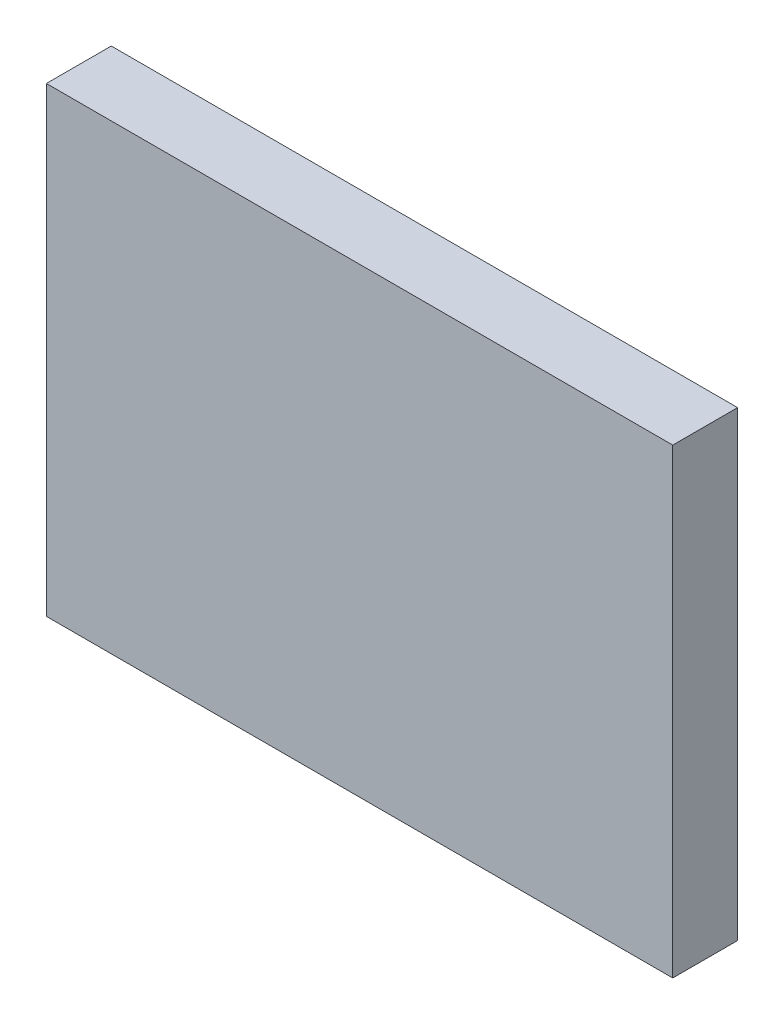
ISO-10303-21;
HEADER;
FILE_DESCRIPTION(('STEP AP214'),'2;1');
FILE_NAME('part.step','',(''),(''),'','','');
FILE_SCHEMA(('AUTOMOTIVE_DESIGN { 1 0 10303 214 1 1 1 1 }'));
ENDSEC;
DATA;
#1=APPLICATION_CONTEXT('core data for automotive mechanical design processes');
#2=APPLICATION_PROTOCOL_DEFINITION('international standard','automotive_design',2000,#1);
#3=PRODUCT_CONTEXT('',#1,'mechanical');
#4=PRODUCT('Part','Part','',(#3));
#5=PRODUCT_RELATED_PRODUCT_CATEGORY('part','',(#4));
#6=PRODUCT_DEFINITION_FORMATION('','',#4);
#7=PRODUCT_DEFINITION_CONTEXT('part definition',#1,'design');
#8=PRODUCT_DEFINITION('design','',#6,#7);
#9=PRODUCT_DEFINITION_SHAPE('','',#8);
#10=(LENGTH_UNIT() NAMED_UNIT(*) SI_UNIT(.MILLI.,.METRE.));
#11=(NAMED_UNIT(*) PLANE_ANGLE_UNIT() SI_UNIT($,.RADIAN.));
#12=(NAMED_UNIT(*) SI_UNIT($,.STERADIAN.) SOLID_ANGLE_UNIT());
#13=UNCERTAINTY_MEASURE_WITH_UNIT(LENGTH_MEASURE(1.E-05),#10,'distance_accuracy_value','');
#14=(GEOMETRIC_REPRESENTATION_CONTEXT(3) GLOBAL_UNCERTAINTY_ASSIGNED_CONTEXT((#13)) GLOBAL_UNIT_ASSIGNED_CONTEXT((#10,
#11,#12)) REPRESENTATION_CONTEXT('',''));
#15=CARTESIAN_POINT('',(0.,0.,0.));
#16=DIRECTION('',(0.,0.,1.));
#17=DIRECTION('',(1.,0.,0.));
#18=AXIS2_PLACEMENT_3D('',#15,#16,#17);
#19=CARTESIAN_POINT('',(-4.826,-3.556,1.));
#20=DIRECTION('',(1.,0.,0.));
#21=DIRECTION('',(0.,0.,-1.));
#22=AXIS2_PLACEMENT_3D('',#19,#20,#21);
#23=PLANE('',#22);
#24=DIRECTION('',(0.,-1.,0.));
#25=VECTOR('',#24,1.);
#26=CARTESIAN_POINT('',(-4.826,-3.556,0.));
#27=LINE('',#26,#25);
#28=CARTESIAN_POINT('',(-4.826,3.556,0.));
#29=VERTEX_POINT('',#28);
#30=CARTESIAN_POINT('',(-4.826,-3.556,0.));
#31=VERTEX_POINT('',#30);
#32=EDGE_CURVE('E95',#29,#31,#27,.T.);
#33=ORIENTED_EDGE('',*,*,#32,.T.);
#34=DIRECTION('',(0.,0.,-1.));
#35=VECTOR('',#34,1.);
#36=CARTESIAN_POINT('',(-4.826,-3.556,1.));
#37=LINE('',#36,#35);
#38=CARTESIAN_POINT('',(-4.826,-3.556,1.));
#39=VERTEX_POINT('',#38);
#40=EDGE_CURVE('E11',#39,#31,#37,.T.);
#41=ORIENTED_EDGE('',*,*,#40,.F.);
#42=DIRECTION('',(0.,-1.,0.));
#43=VECTOR('',#42,1.);
#44=CARTESIAN_POINT('',(-4.826,-3.556,1.));
#45=LINE('',#44,#43);
#46=CARTESIAN_POINT('',(-4.826,3.556,1.));
#47=VERTEX_POINT('',#46);
#48=EDGE_CURVE('E83',#47,#39,#45,.T.);
#49=ORIENTED_EDGE('',*,*,#48,.F.);
#50=DIRECTION('',(0.,0.,-1.));
#51=VECTOR('',#50,1.);
#52=CARTESIAN_POINT('',(-4.826,3.556,1.));
#53=LINE('',#52,#51);
#54=EDGE_CURVE('E91',#47,#29,#53,.T.);
#55=ORIENTED_EDGE('',*,*,#54,.T.);
#56=EDGE_LOOP('',(#33,#41,#49,#55));
#57=FACE_BOUND('',#56,.T.);
#58=ADVANCED_FACE('F32',(#57),#23,.F.);
#59=CARTESIAN_POINT('',(4.826,-3.556,1.));
#60=DIRECTION('',(0.,1.,0.));
#61=DIRECTION('',(0.,0.,1.));
#62=AXIS2_PLACEMENT_3D('',#59,#60,#61);
#63=PLANE('',#62);
#64=DIRECTION('',(1.,0.,0.));
#65=VECTOR('',#64,1.);
#66=CARTESIAN_POINT('',(4.826,-3.556,0.));
#67=LINE('',#66,#65);
#68=CARTESIAN_POINT('',(4.826,-3.556,0.));
#69=VERTEX_POINT('',#68);
#70=EDGE_CURVE('E87',#31,#69,#67,.T.);
#71=ORIENTED_EDGE('',*,*,#70,.T.);
#72=DIRECTION('',(0.,0.,-1.));
#73=VECTOR('',#72,1.);
#74=CARTESIAN_POINT('',(4.826,-3.556,1.));
#75=LINE('',#74,#73);
#76=CARTESIAN_POINT('',(4.826,-3.556,1.));
#77=VERTEX_POINT('',#76);
#78=EDGE_CURVE('E40',#77,#69,#75,.T.);
#79=ORIENTED_EDGE('',*,*,#78,.F.);
#80=DIRECTION('',(1.,0.,0.));
#81=VECTOR('',#80,1.);
#82=CARTESIAN_POINT('',(4.826,-3.556,1.));
#83=LINE('',#82,#81);
#84=EDGE_CURVE('E78',#39,#77,#83,.T.);
#85=ORIENTED_EDGE('',*,*,#84,.F.);
#86=ORIENTED_EDGE('',*,*,#40,.T.);
#87=EDGE_LOOP('',(#71,#79,#85,#86));
#88=FACE_BOUND('',#87,.T.);
#89=ADVANCED_FACE('F86',(#88),#63,.F.);
#90=CARTESIAN_POINT('',(4.826,3.556,1.));
#91=DIRECTION('',(-1.,0.,0.));
#92=DIRECTION('',(0.,0.,1.));
#93=AXIS2_PLACEMENT_3D('',#90,#91,#92);
#94=PLANE('',#93);
#95=DIRECTION('',(0.,1.,0.));
#96=VECTOR('',#95,1.);
#97=CARTESIAN_POINT('',(4.826,3.556,0.));
#98=LINE('',#97,#96);
#99=CARTESIAN_POINT('',(4.826,3.556,0.));
#100=VERTEX_POINT('',#99);
#101=EDGE_CURVE('E65',#69,#100,#98,.T.);
#102=ORIENTED_EDGE('',*,*,#101,.T.);
#103=DIRECTION('',(0.,0.,-1.));
#104=VECTOR('',#103,1.);
#105=CARTESIAN_POINT('',(4.826,3.556,1.));
#106=LINE('',#105,#104);
#107=CARTESIAN_POINT('',(4.826,3.556,1.));
#108=VERTEX_POINT('',#107);
#109=EDGE_CURVE('E88',#108,#100,#106,.T.);
#110=ORIENTED_EDGE('',*,*,#109,.F.);
#111=DIRECTION('',(0.,1.,0.));
#112=VECTOR('',#111,1.);
#113=CARTESIAN_POINT('',(4.826,3.556,1.));
#114=LINE('',#113,#112);
#115=EDGE_CURVE('E81',#77,#108,#114,.T.);
#116=ORIENTED_EDGE('',*,*,#115,.F.);
#117=ORIENTED_EDGE('',*,*,#78,.T.);
#118=EDGE_LOOP('',(#102,#110,#116,#117));
#119=FACE_BOUND('',#118,.T.);
#120=ADVANCED_FACE('F89',(#119),#94,.F.);
#121=CARTESIAN_POINT('',(-4.826,3.556,1.));
#122=DIRECTION('',(0.,-1.,0.));
#123=DIRECTION('',(0.,0.,-1.));
#124=AXIS2_PLACEMENT_3D('',#121,#122,#123);
#125=PLANE('',#124);
#126=DIRECTION('',(-1.,0.,0.));
#127=VECTOR('',#126,1.);
#128=CARTESIAN_POINT('',(-4.826,3.556,0.));
#129=LINE('',#128,#127);
#130=EDGE_CURVE('E71',#100,#29,#129,.T.);
#131=ORIENTED_EDGE('',*,*,#130,.T.);
#132=ORIENTED_EDGE('',*,*,#54,.F.);
#133=DIRECTION('',(-1.,0.,0.));
#134=VECTOR('',#133,1.);
#135=CARTESIAN_POINT('',(-4.826,3.556,1.));
#136=LINE('',#135,#134);
#137=EDGE_CURVE('E48',#108,#47,#136,.T.);
#138=ORIENTED_EDGE('',*,*,#137,.F.);
#139=ORIENTED_EDGE('',*,*,#109,.T.);
#140=EDGE_LOOP('',(#131,#132,#138,#139));
#141=FACE_BOUND('',#140,.T.);
#142=ADVANCED_FACE('F102',(#141),#125,.F.);
#143=CARTESIAN_POINT('',(0.,0.,1.));
#144=DIRECTION('',(0.,0.,-1.));
#145=DIRECTION('',(-1.,0.,0.));
#146=AXIS2_PLACEMENT_3D('',#143,#144,#145);
#147=PLANE('',#146);
#148=ORIENTED_EDGE('',*,*,#48,.T.);
#149=ORIENTED_EDGE('',*,*,#84,.T.);
#150=ORIENTED_EDGE('',*,*,#115,.T.);
#151=ORIENTED_EDGE('',*,*,#137,.T.);
#152=EDGE_LOOP('',(#148,#149,#150,#151));
#153=FACE_BOUND('',#152,.T.);
#154=ADVANCED_FACE('F79',(#153),#147,.F.);
#155=CARTESIAN_POINT('',(0.,0.,0.));
#156=DIRECTION('',(0.,0.,-1.));
#157=DIRECTION('',(-1.,0.,0.));
#158=AXIS2_PLACEMENT_3D('',#155,#156,#157);
#159=PLANE('',#158);
#160=ORIENTED_EDGE('',*,*,#32,.F.);
#161=ORIENTED_EDGE('',*,*,#130,.F.);
#162=ORIENTED_EDGE('',*,*,#101,.F.);
#163=ORIENTED_EDGE('',*,*,#70,.F.);
#164=EDGE_LOOP('',(#160,#161,#162,#163));
#165=FACE_BOUND('',#164,.T.);
#166=ADVANCED_FACE('F105',(#165),#159,.T.);
#167=CLOSED_SHELL('',(#58,#89,#120,#142,#154,#166));
#168=MANIFOLD_SOLID_BREP('B2',#167);
#169=ADVANCED_BREP_SHAPE_REPRESENTATION('',(#18,#168),#14);
#170=SHAPE_DEFINITION_REPRESENTATION(#9,#169);
ENDSEC;
END-ISO-10303-21;
